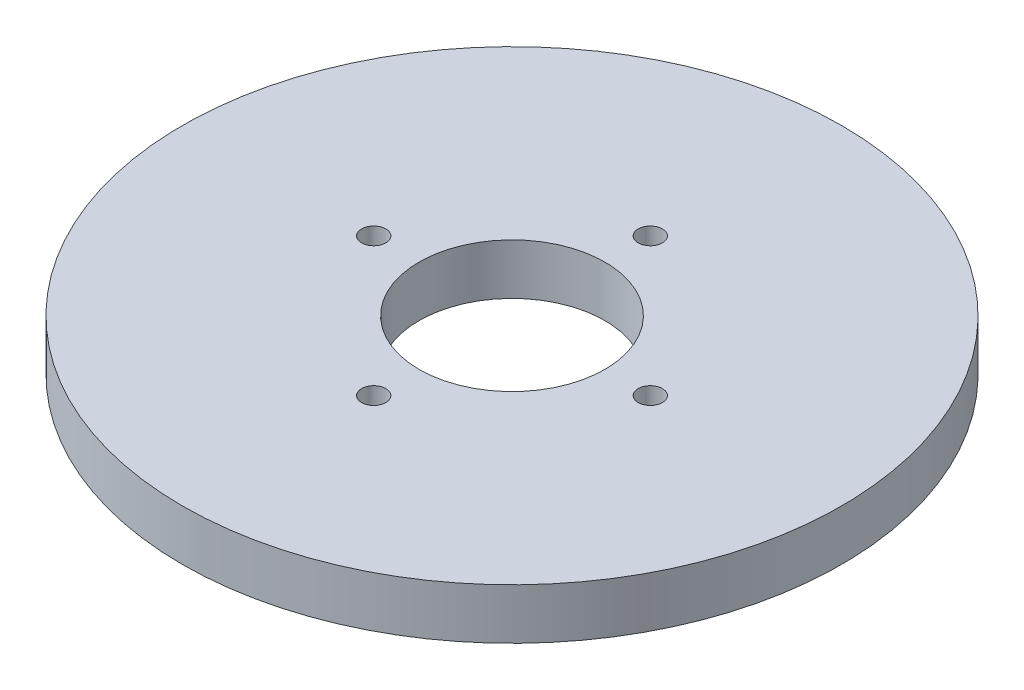
ISO-10303-21;
HEADER;
FILE_DESCRIPTION(('STEP AP214'),'2;1');
FILE_NAME('part.step','',(''),(''),'','','');
FILE_SCHEMA(('AUTOMOTIVE_DESIGN { 1 0 10303 214 1 1 1 1 }'));
ENDSEC;
DATA;
#1=APPLICATION_CONTEXT('core data for automotive mechanical design processes');
#2=APPLICATION_PROTOCOL_DEFINITION('international standard','automotive_design',2000,#1);
#3=PRODUCT_CONTEXT('',#1,'mechanical');
#4=PRODUCT('Part','Part','',(#3));
#5=PRODUCT_RELATED_PRODUCT_CATEGORY('part','',(#4));
#6=PRODUCT_DEFINITION_FORMATION('','',#4);
#7=PRODUCT_DEFINITION_CONTEXT('part definition',#1,'design');
#8=PRODUCT_DEFINITION('design','',#6,#7);
#9=PRODUCT_DEFINITION_SHAPE('','',#8);
#10=(LENGTH_UNIT() NAMED_UNIT(*) SI_UNIT(.MILLI.,.METRE.));
#11=(NAMED_UNIT(*) PLANE_ANGLE_UNIT() SI_UNIT($,.RADIAN.));
#12=(NAMED_UNIT(*) SI_UNIT($,.STERADIAN.) SOLID_ANGLE_UNIT());
#13=UNCERTAINTY_MEASURE_WITH_UNIT(LENGTH_MEASURE(1.E-05),#10,'distance_accuracy_value','');
#14=(GEOMETRIC_REPRESENTATION_CONTEXT(3) GLOBAL_UNCERTAINTY_ASSIGNED_CONTEXT((#13)) GLOBAL_UNIT_ASSIGNED_CONTEXT((#10,
#11,#12)) REPRESENTATION_CONTEXT('',''));
#15=CARTESIAN_POINT('',(0.,0.,0.));
#16=DIRECTION('',(0.,0.,1.));
#17=DIRECTION('',(1.,0.,0.));
#18=AXIS2_PLACEMENT_3D('',#15,#16,#17);
#19=CARTESIAN_POINT('',(0.,15.,0.));
#20=DIRECTION('',(0.,-1.,0.));
#21=DIRECTION('',(0.,0.,-1.));
#22=AXIS2_PLACEMENT_3D('',#19,#20,#21);
#23=CYLINDRICAL_SURFACE('',#22,97.5);
#24=CARTESIAN_POINT('',(0.,15.,0.));
#25=DIRECTION('',(0.,1.,0.));
#26=DIRECTION('',(0.,0.,1.));
#27=AXIS2_PLACEMENT_3D('',#24,#25,#26);
#28=CIRCLE('',#27,97.5);
#29=CARTESIAN_POINT('',(0.,15.,97.5));
#30=VERTEX_POINT('',#29);
#31=EDGE_CURVE('E10',#30,#30,#28,.T.);
#32=ORIENTED_EDGE('',*,*,#31,.F.);
#33=EDGE_LOOP('',(#32));
#34=FACE_BOUND('',#33,.T.);
#35=CARTESIAN_POINT('',(0.,0.,0.));
#36=DIRECTION('',(0.,1.,0.));
#37=DIRECTION('',(0.,0.,1.));
#38=AXIS2_PLACEMENT_3D('',#35,#36,#37);
#39=CIRCLE('',#38,97.5);
#40=CARTESIAN_POINT('',(0.,0.,97.5));
#41=VERTEX_POINT('',#40);
#42=EDGE_CURVE('E37',#41,#41,#39,.T.);
#43=ORIENTED_EDGE('',*,*,#42,.T.);
#44=EDGE_LOOP('',(#43));
#45=FACE_BOUND('',#44,.T.);
#46=ADVANCED_FACE('F40',(#34,#45),#23,.T.);
#47=CARTESIAN_POINT('',(0.,15.,0.));
#48=DIRECTION('',(0.,1.,0.));
#49=DIRECTION('',(0.,0.,1.));
#50=AXIS2_PLACEMENT_3D('',#47,#48,#49);
#51=PLANE('',#50);
#52=CARTESIAN_POINT('',(1.42843780219517E-13,15.,40.9120846874829));
#53=DIRECTION('',(0.,1.,0.));
#54=DIRECTION('',(1.,0.,0.));
#55=AXIS2_PLACEMENT_3D('',#52,#53,#54);
#56=CIRCLE('',#55,3.58964056744345);
#57=CARTESIAN_POINT('',(1.42843780219517E-13,15.,44.5017252549264));
#58=VERTEX_POINT('',#57);
#59=EDGE_CURVE('E71',#58,#58,#56,.T.);
#60=ORIENTED_EDGE('',*,*,#59,.F.);
#61=EDGE_LOOP('',(#60));
#62=FACE_BOUND('',#61,.T.);
#63=CARTESIAN_POINT('',(40.9120846874829,15.,0.));
#64=DIRECTION('',(0.,1.,0.));
#65=DIRECTION('',(0.,0.,-1.));
#66=AXIS2_PLACEMENT_3D('',#63,#64,#65);
#67=CIRCLE('',#66,3.58964056744345);
#68=CARTESIAN_POINT('',(40.9120846874829,15.,3.58964056744345));
#69=VERTEX_POINT('',#68);
#70=EDGE_CURVE('E70',#69,#69,#67,.T.);
#71=ORIENTED_EDGE('',*,*,#70,.F.);
#72=EDGE_LOOP('',(#71));
#73=FACE_BOUND('',#72,.T.);
#74=CARTESIAN_POINT('',(-4.2853134065855E-13,15.,-40.9120846874829));
#75=DIRECTION('',(0.,1.,0.));
#76=DIRECTION('',(-1.,0.,0.));
#77=AXIS2_PLACEMENT_3D('',#74,#75,#76);
#78=CIRCLE('',#77,3.58964056744345);
#79=CARTESIAN_POINT('',(-4.2853134065855E-13,15.,-37.3224441200395));
#80=VERTEX_POINT('',#79);
#81=EDGE_CURVE('E61',#80,#80,#78,.T.);
#82=ORIENTED_EDGE('',*,*,#81,.F.);
#83=EDGE_LOOP('',(#82));
#84=FACE_BOUND('',#83,.T.);
#85=CARTESIAN_POINT('',(-40.9120846874829,15.,0.));
#86=DIRECTION('',(0.,1.,0.));
#87=DIRECTION('',(0.,0.,1.));
#88=AXIS2_PLACEMENT_3D('',#85,#86,#87);
#89=CIRCLE('',#88,3.58964056744345);
#90=CARTESIAN_POINT('',(-40.9120846874829,15.,3.58964056744345));
#91=VERTEX_POINT('',#90);
#92=EDGE_CURVE('E54',#91,#91,#89,.T.);
#93=ORIENTED_EDGE('',*,*,#92,.F.);
#94=EDGE_LOOP('',(#93));
#95=FACE_BOUND('',#94,.T.);
#96=CARTESIAN_POINT('',(0.,15.,0.));
#97=DIRECTION('',(0.,1.,0.));
#98=DIRECTION('',(0.,0.,1.));
#99=AXIS2_PLACEMENT_3D('',#96,#97,#98);
#100=CIRCLE('',#99,27.5);
#101=CARTESIAN_POINT('',(0.,15.,27.5));
#102=VERTEX_POINT('',#101);
#103=EDGE_CURVE('E50',#102,#102,#100,.T.);
#104=ORIENTED_EDGE('',*,*,#103,.F.);
#105=EDGE_LOOP('',(#104));
#106=FACE_BOUND('',#105,.T.);
#107=ORIENTED_EDGE('',*,*,#31,.T.);
#108=EDGE_LOOP('',(#107));
#109=FACE_BOUND('',#108,.T.);
#110=ADVANCED_FACE('F86',(#62,#73,#84,#95,#106,#109),#51,.T.);
#111=CARTESIAN_POINT('',(0.,0.,0.));
#112=DIRECTION('',(0.,1.,0.));
#113=DIRECTION('',(0.,0.,1.));
#114=AXIS2_PLACEMENT_3D('',#111,#112,#113);
#115=PLANE('',#114);
#116=CARTESIAN_POINT('',(0.,0.,0.));
#117=DIRECTION('',(0.,1.,0.));
#118=DIRECTION('',(0.,0.,1.));
#119=AXIS2_PLACEMENT_3D('',#116,#117,#118);
#120=CIRCLE('',#119,27.5);
#121=CARTESIAN_POINT('',(0.,0.,27.5));
#122=VERTEX_POINT('',#121);
#123=EDGE_CURVE('E47',#122,#122,#120,.T.);
#124=ORIENTED_EDGE('',*,*,#123,.T.);
#125=EDGE_LOOP('',(#124));
#126=FACE_BOUND('',#125,.T.);
#127=ORIENTED_EDGE('',*,*,#42,.F.);
#128=EDGE_LOOP('',(#127));
#129=FACE_BOUND('',#128,.T.);
#130=ADVANCED_FACE('F93',(#126,#129),#115,.F.);
#131=CARTESIAN_POINT('',(0.,15.,0.));
#132=DIRECTION('',(0.,-1.,0.));
#133=DIRECTION('',(0.,0.,-1.));
#134=AXIS2_PLACEMENT_3D('',#131,#132,#133);
#135=CYLINDRICAL_SURFACE('',#134,27.5);
#136=ORIENTED_EDGE('',*,*,#103,.T.);
#137=EDGE_LOOP('',(#136));
#138=FACE_BOUND('',#137,.T.);
#139=ORIENTED_EDGE('',*,*,#123,.F.);
#140=EDGE_LOOP('',(#139));
#141=FACE_BOUND('',#140,.T.);
#142=ADVANCED_FACE('F101',(#138,#141),#135,.F.);
#143=CARTESIAN_POINT('',(-40.9120846874829,5.35384562569408,0.));
#144=DIRECTION('',(0.,1.,0.));
#145=DIRECTION('',(0.,0.,1.));
#146=AXIS2_PLACEMENT_3D('',#143,#144,#145);
#147=CYLINDRICAL_SURFACE('',#146,3.58964056744345);
#148=CARTESIAN_POINT('',(-40.9120846874829,5.35384562569408,0.));
#149=DIRECTION('',(0.,1.,0.));
#150=DIRECTION('',(0.,0.,1.));
#151=AXIS2_PLACEMENT_3D('',#148,#149,#150);
#152=CIRCLE('',#151,3.58964056744345);
#153=CARTESIAN_POINT('',(-40.9120846874829,5.35384562569408,3.58964056744345));
#154=VERTEX_POINT('',#153);
#155=EDGE_CURVE('E55',#154,#154,#152,.T.);
#156=CARTESIAN_POINT('',(-40.9120846874829,5.35384562569408,3.58964056744345));
#157=CARTESIAN_POINT('',(-40.9120846874829,5.45432640042643,3.58964056744345));
#158=CARTESIAN_POINT('',(-40.9120846874829,5.55480717515879,3.58964056744345));
#159=CARTESIAN_POINT('',(-40.9120846874829,5.75576872462349,3.58964056744345));
#160=CARTESIAN_POINT('',(-40.9120846874829,5.85624949935585,3.58964056744345));
#161=CARTESIAN_POINT('',(-40.9120846874829,6.05721104882055,3.58964056744345));
#162=CARTESIAN_POINT('',(-40.9120846874829,6.15769182355291,3.58964056744345));
#163=CARTESIAN_POINT('',(-40.9120846874829,6.35865337301761,3.58964056744345));
#164=CARTESIAN_POINT('',(-40.9120846874829,6.45913414774997,3.58964056744345));
#165=CARTESIAN_POINT('',(-40.9120846874829,6.66009569721467,3.58964056744345));
#166=CARTESIAN_POINT('',(-40.9120846874829,6.76057647194703,3.58964056744345));
#167=CARTESIAN_POINT('',(-40.9120846874829,6.96153802141173,3.58964056744345));
#168=CARTESIAN_POINT('',(-40.9120846874829,7.06201879614409,3.58964056744345));
#169=CARTESIAN_POINT('',(-40.9120846874829,7.26298034560879,3.58964056744345));
#170=CARTESIAN_POINT('',(-40.9120846874829,7.36346112034115,3.58964056744345));
#171=CARTESIAN_POINT('',(-40.9120846874829,7.56442266980585,3.58964056744345));
#172=CARTESIAN_POINT('',(-40.9120846874829,7.6649034445382,3.58964056744345));
#173=CARTESIAN_POINT('',(-40.9120846874829,7.86586499400291,3.58964056744345));
#174=CARTESIAN_POINT('',(-40.9120846874829,7.96634576873527,3.58964056744345));
#175=CARTESIAN_POINT('',(-40.9120846874829,8.16730731819997,3.58964056744345));
#176=CARTESIAN_POINT('',(-40.9120846874829,8.26778809293232,3.58964056744345));
#177=CARTESIAN_POINT('',(-40.9120846874829,8.46874964239703,3.58964056744345));
#178=CARTESIAN_POINT('',(-40.9120846874829,8.56923041712939,3.58964056744345));
#179=CARTESIAN_POINT('',(-40.9120846874829,8.77019196659409,3.58964056744345));
#180=CARTESIAN_POINT('',(-40.9120846874829,8.87067274132645,3.58964056744345));
#181=CARTESIAN_POINT('',(-40.9120846874829,9.07163429079115,3.58964056744345));
#182=CARTESIAN_POINT('',(-40.9120846874829,9.1721150655235,3.58964056744345));
#183=CARTESIAN_POINT('',(-40.9120846874829,9.37307661498821,3.58964056744345));
#184=CARTESIAN_POINT('',(-40.9120846874829,9.47355738972056,3.58964056744345));
#185=CARTESIAN_POINT('',(-40.9120846874829,9.67451893918527,3.58964056744345));
#186=CARTESIAN_POINT('',(-40.9120846874829,9.77499971391762,3.58964056744345));
#187=CARTESIAN_POINT('',(-40.9120846874829,9.97596126338233,3.58964056744345));
#188=CARTESIAN_POINT('',(-40.9120846874829,10.0764420381147,3.58964056744345));
#189=CARTESIAN_POINT('',(-40.9120846874829,10.2774035875794,3.58964056744345));
#190=CARTESIAN_POINT('',(-40.9120846874829,10.3778843623117,3.58964056744345));
#191=CARTESIAN_POINT('',(-40.9120846874829,10.5788459117765,3.58964056744345));
#192=CARTESIAN_POINT('',(-40.9120846874829,10.6793266865088,3.58964056744345));
#193=CARTESIAN_POINT('',(-40.9120846874829,10.8802882359735,3.58964056744345));
#194=CARTESIAN_POINT('',(-40.9120846874829,10.9807690107059,3.58964056744345));
#195=CARTESIAN_POINT('',(-40.9120846874829,11.1817305601706,3.58964056744345));
#196=CARTESIAN_POINT('',(-40.9120846874829,11.2822113349029,3.58964056744345));
#197=CARTESIAN_POINT('',(-40.9120846874829,11.4831728843676,3.58964056744345));
#198=CARTESIAN_POINT('',(-40.9120846874829,11.5836536591,3.58964056744345));
#199=CARTESIAN_POINT('',(-40.9120846874829,11.7846152085647,3.58964056744345));
#200=CARTESIAN_POINT('',(-40.9120846874829,11.885095983297,3.58964056744345));
#201=CARTESIAN_POINT('',(-40.9120846874829,12.0860575327617,3.58964056744345));
#202=CARTESIAN_POINT('',(-40.9120846874829,12.1865383074941,3.58964056744345));
#203=CARTESIAN_POINT('',(-40.9120846874829,12.3874998569588,3.58964056744345));
#204=CARTESIAN_POINT('',(-40.9120846874829,12.4879806316912,3.58964056744345));
#205=CARTESIAN_POINT('',(-40.9120846874829,12.6889421811559,3.58964056744345));
#206=CARTESIAN_POINT('',(-40.9120846874829,12.7894229558882,3.58964056744345));
#207=CARTESIAN_POINT('',(-40.9120846874829,12.9903845053529,3.58964056744345));
#208=CARTESIAN_POINT('',(-40.9120846874829,13.0908652800853,3.58964056744345));
#209=CARTESIAN_POINT('',(-40.9120846874829,13.29182682955,3.58964056744345));
#210=CARTESIAN_POINT('',(-40.9120846874829,13.3923076042823,3.58964056744345));
#211=CARTESIAN_POINT('',(-40.9120846874829,13.5932691537471,3.58964056744345));
#212=CARTESIAN_POINT('',(-40.9120846874829,13.6937499284794,3.58964056744345));
#213=CARTESIAN_POINT('',(-40.9120846874829,13.8947114779441,3.58964056744345));
#214=CARTESIAN_POINT('',(-40.9120846874829,13.9951922526765,3.58964056744345));
#215=CARTESIAN_POINT('',(-40.9120846874829,14.1961538021412,3.58964056744345));
#216=CARTESIAN_POINT('',(-40.9120846874829,14.2966345768735,3.58964056744345));
#217=CARTESIAN_POINT('',(-40.9120846874829,14.4975961263382,3.58964056744345));
#218=CARTESIAN_POINT('',(-40.9120846874829,14.5980769010706,3.58964056744345));
#219=CARTESIAN_POINT('',(-40.9120846874829,14.7990384505353,3.58964056744345));
#220=CARTESIAN_POINT('',(-40.9120846874829,14.8995192252676,3.58964056744345));
#221=CARTESIAN_POINT('',(-40.9120846874829,15.,3.58964056744345));
#222=B_SPLINE_CURVE_WITH_KNOTS('',3,(#156,#157,#158,#159,#160,#161,#162,#163,#164,#165,#166,
#167,#168,#169,#170,#171,#172,#173,#174,#175,#176,#177,#178,#179,#180,#181,#182,#183,#184,#185,
#186,#187,#188,#189,#190,#191,#192,#193,#194,#195,#196,#197,#198,#199,#200,#201,#202,#203,#204,
#205,#206,#207,#208,#209,#210,#211,#212,#213,#214,#215,#216,#217,#218,#219,#220,#221),
.UNSPECIFIED.,.F.,.F.,(4,2,2,2,2,2,2,2,2,2,2,2,2,2,2,2,2,2,2,2,2,2,2,2,2,2,2,2,2,2,2,2,4),(0.,
0.301442324197061,0.60288464839412,0.904326972591181,1.20576929678824,1.5072116209853,
1.80865394518236,2.11009626937942,2.41153859357648,2.71298091777354,3.0144232419706,
3.31586556616766,3.61730789036472,3.91875021456178,4.22019253875884,4.5216348629559,
4.82307718715296,5.12451951135002,5.42596183554708,5.72740415974414,6.0288464839412,
6.33028880813826,6.63173113233532,6.93317345653238,7.23461578072944,7.5360581049265,
7.83750042912356,8.13894275332062,8.44038507751768,8.74182740171474,9.0432697259118,
9.34471205010886,9.64615437430592),.UNSPECIFIED.);
#223=EDGE_CURVE('BSEAM102',#154,#91,#222,.T.);
#224=ORIENTED_EDGE('',*,*,#155,.F.);
#225=ORIENTED_EDGE('',*,*,#92,.T.);
#226=ORIENTED_EDGE('',*,*,#223,.T.);
#227=ORIENTED_EDGE('',*,*,#223,.F.);
#228=EDGE_LOOP('',(#224,#226,#225,#227));
#229=FACE_BOUND('',#228,.T.);
#230=ADVANCED_FACE('F102',(#229),#147,.F.);
#231=CARTESIAN_POINT('',(-40.9120846874829,5.35384562569408,0.));
#232=DIRECTION('',(0.,1.,0.));
#233=DIRECTION('',(0.,0.,1.));
#234=AXIS2_PLACEMENT_3D('',#231,#232,#233);
#235=PLANE('',#234);
#236=ORIENTED_EDGE('',*,*,#155,.T.);
#237=EDGE_LOOP('',(#236));
#238=FACE_BOUND('',#237,.T.);
#239=ADVANCED_FACE('F133',(#238),#235,.T.);
#240=CARTESIAN_POINT('',(-4.2853134065855E-13,5.35384562569408,-40.9120846874829));
#241=DIRECTION('',(0.,1.,0.));
#242=DIRECTION('',(0.,0.,1.));
#243=AXIS2_PLACEMENT_3D('',#240,#241,#242);
#244=CYLINDRICAL_SURFACE('',#243,3.58964056744345);
#245=CARTESIAN_POINT('',(-4.2853134065855E-13,5.35384562569408,-40.9120846874829));
#246=DIRECTION('',(0.,1.,0.));
#247=DIRECTION('',(-1.,0.,0.));
#248=AXIS2_PLACEMENT_3D('',#245,#246,#247);
#249=CIRCLE('',#248,3.58964056744345);
#250=CARTESIAN_POINT('',(-4.2853134065855E-13,5.35384562569408,-37.3224441200395));
#251=VERTEX_POINT('',#250);
#252=EDGE_CURVE('E63',#251,#251,#249,.T.);
#253=CARTESIAN_POINT('',(-4.2853134065855E-13,5.35384562569408,-37.3224441200395));
#254=CARTESIAN_POINT('',(-4.2853134065855E-13,5.45432640042643,-37.3224441200395));
#255=CARTESIAN_POINT('',(-4.2853134065855E-13,5.55480717515879,-37.3224441200395));
#256=CARTESIAN_POINT('',(-4.2853134065855E-13,5.75576872462349,-37.3224441200395));
#257=CARTESIAN_POINT('',(-4.2853134065855E-13,5.85624949935585,-37.3224441200395));
#258=CARTESIAN_POINT('',(-4.2853134065855E-13,6.05721104882055,-37.3224441200395));
#259=CARTESIAN_POINT('',(-4.2853134065855E-13,6.15769182355291,-37.3224441200395));
#260=CARTESIAN_POINT('',(-4.2853134065855E-13,6.35865337301761,-37.3224441200395));
#261=CARTESIAN_POINT('',(-4.2853134065855E-13,6.45913414774997,-37.3224441200395));
#262=CARTESIAN_POINT('',(-4.2853134065855E-13,6.66009569721467,-37.3224441200395));
#263=CARTESIAN_POINT('',(-4.2853134065855E-13,6.76057647194703,-37.3224441200395));
#264=CARTESIAN_POINT('',(-4.2853134065855E-13,6.96153802141173,-37.3224441200395));
#265=CARTESIAN_POINT('',(-4.2853134065855E-13,7.06201879614409,-37.3224441200395));
#266=CARTESIAN_POINT('',(-4.2853134065855E-13,7.26298034560879,-37.3224441200395));
#267=CARTESIAN_POINT('',(-4.2853134065855E-13,7.36346112034115,-37.3224441200395));
#268=CARTESIAN_POINT('',(-4.2853134065855E-13,7.56442266980585,-37.3224441200395));
#269=CARTESIAN_POINT('',(-4.2853134065855E-13,7.6649034445382,-37.3224441200395));
#270=CARTESIAN_POINT('',(-4.2853134065855E-13,7.86586499400291,-37.3224441200395));
#271=CARTESIAN_POINT('',(-4.2853134065855E-13,7.96634576873527,-37.3224441200395));
#272=CARTESIAN_POINT('',(-4.2853134065855E-13,8.16730731819997,-37.3224441200395));
#273=CARTESIAN_POINT('',(-4.2853134065855E-13,8.26778809293232,-37.3224441200395));
#274=CARTESIAN_POINT('',(-4.2853134065855E-13,8.46874964239703,-37.3224441200395));
#275=CARTESIAN_POINT('',(-4.2853134065855E-13,8.56923041712939,-37.3224441200395));
#276=CARTESIAN_POINT('',(-4.2853134065855E-13,8.77019196659409,-37.3224441200395));
#277=CARTESIAN_POINT('',(-4.2853134065855E-13,8.87067274132645,-37.3224441200395));
#278=CARTESIAN_POINT('',(-4.2853134065855E-13,9.07163429079115,-37.3224441200395));
#279=CARTESIAN_POINT('',(-4.2853134065855E-13,9.1721150655235,-37.3224441200395));
#280=CARTESIAN_POINT('',(-4.2853134065855E-13,9.37307661498821,-37.3224441200395));
#281=CARTESIAN_POINT('',(-4.2853134065855E-13,9.47355738972056,-37.3224441200395));
#282=CARTESIAN_POINT('',(-4.2853134065855E-13,9.67451893918527,-37.3224441200395));
#283=CARTESIAN_POINT('',(-4.2853134065855E-13,9.77499971391762,-37.3224441200395));
#284=CARTESIAN_POINT('',(-4.2853134065855E-13,9.97596126338233,-37.3224441200395));
#285=CARTESIAN_POINT('',(-4.2853134065855E-13,10.0764420381147,-37.3224441200395));
#286=CARTESIAN_POINT('',(-4.2853134065855E-13,10.2774035875794,-37.3224441200395));
#287=CARTESIAN_POINT('',(-4.2853134065855E-13,10.3778843623117,-37.3224441200395));
#288=CARTESIAN_POINT('',(-4.2853134065855E-13,10.5788459117765,-37.3224441200395));
#289=CARTESIAN_POINT('',(-4.2853134065855E-13,10.6793266865088,-37.3224441200395));
#290=CARTESIAN_POINT('',(-4.2853134065855E-13,10.8802882359735,-37.3224441200395));
#291=CARTESIAN_POINT('',(-4.2853134065855E-13,10.9807690107059,-37.3224441200395));
#292=CARTESIAN_POINT('',(-4.2853134065855E-13,11.1817305601706,-37.3224441200395));
#293=CARTESIAN_POINT('',(-4.2853134065855E-13,11.2822113349029,-37.3224441200395));
#294=CARTESIAN_POINT('',(-4.2853134065855E-13,11.4831728843676,-37.3224441200395));
#295=CARTESIAN_POINT('',(-4.2853134065855E-13,11.5836536591,-37.3224441200395));
#296=CARTESIAN_POINT('',(-4.2853134065855E-13,11.7846152085647,-37.3224441200395));
#297=CARTESIAN_POINT('',(-4.2853134065855E-13,11.885095983297,-37.3224441200395));
#298=CARTESIAN_POINT('',(-4.2853134065855E-13,12.0860575327617,-37.3224441200395));
#299=CARTESIAN_POINT('',(-4.2853134065855E-13,12.1865383074941,-37.3224441200395));
#300=CARTESIAN_POINT('',(-4.2853134065855E-13,12.3874998569588,-37.3224441200395));
#301=CARTESIAN_POINT('',(-4.2853134065855E-13,12.4879806316912,-37.3224441200395));
#302=CARTESIAN_POINT('',(-4.2853134065855E-13,12.6889421811559,-37.3224441200395));
#303=CARTESIAN_POINT('',(-4.2853134065855E-13,12.7894229558882,-37.3224441200395));
#304=CARTESIAN_POINT('',(-4.2853134065855E-13,12.9903845053529,-37.3224441200395));
#305=CARTESIAN_POINT('',(-4.2853134065855E-13,13.0908652800853,-37.3224441200395));
#306=CARTESIAN_POINT('',(-4.2853134065855E-13,13.29182682955,-37.3224441200395));
#307=CARTESIAN_POINT('',(-4.2853134065855E-13,13.3923076042823,-37.3224441200395));
#308=CARTESIAN_POINT('',(-4.2853134065855E-13,13.5932691537471,-37.3224441200395));
#309=CARTESIAN_POINT('',(-4.2853134065855E-13,13.6937499284794,-37.3224441200395));
#310=CARTESIAN_POINT('',(-4.2853134065855E-13,13.8947114779441,-37.3224441200395));
#311=CARTESIAN_POINT('',(-4.2853134065855E-13,13.9951922526765,-37.3224441200395));
#312=CARTESIAN_POINT('',(-4.2853134065855E-13,14.1961538021412,-37.3224441200395));
#313=CARTESIAN_POINT('',(-4.2853134065855E-13,14.2966345768735,-37.3224441200395));
#314=CARTESIAN_POINT('',(-4.2853134065855E-13,14.4975961263382,-37.3224441200395));
#315=CARTESIAN_POINT('',(-4.2853134065855E-13,14.5980769010706,-37.3224441200395));
#316=CARTESIAN_POINT('',(-4.2853134065855E-13,14.7990384505353,-37.3224441200395));
#317=CARTESIAN_POINT('',(-4.2853134065855E-13,14.8995192252676,-37.3224441200395));
#318=CARTESIAN_POINT('',(-4.2853134065855E-13,15.,-37.3224441200395));
#319=B_SPLINE_CURVE_WITH_KNOTS('',3,(#253,#254,#255,#256,#257,#258,#259,#260,#261,#262,#263,
#264,#265,#266,#267,#268,#269,#270,#271,#272,#273,#274,#275,#276,#277,#278,#279,#280,#281,#282,
#283,#284,#285,#286,#287,#288,#289,#290,#291,#292,#293,#294,#295,#296,#297,#298,#299,#300,#301,
#302,#303,#304,#305,#306,#307,#308,#309,#310,#311,#312,#313,#314,#315,#316,#317,#318),
.UNSPECIFIED.,.F.,.F.,(4,2,2,2,2,2,2,2,2,2,2,2,2,2,2,2,2,2,2,2,2,2,2,2,2,2,2,2,2,2,2,2,4),(0.,
0.301442324197061,0.60288464839412,0.904326972591181,1.20576929678824,1.5072116209853,
1.80865394518236,2.11009626937942,2.41153859357648,2.71298091777354,3.0144232419706,
3.31586556616766,3.61730789036472,3.91875021456178,4.22019253875884,4.5216348629559,
4.82307718715296,5.12451951135002,5.42596183554708,5.72740415974414,6.0288464839412,
6.33028880813826,6.63173113233532,6.93317345653238,7.23461578072944,7.5360581049265,
7.83750042912356,8.13894275332062,8.44038507751768,8.74182740171474,9.0432697259118,
9.34471205010886,9.64615437430592),.UNSPECIFIED.);
#320=EDGE_CURVE('BSEAM142',#251,#80,#319,.T.);
#321=ORIENTED_EDGE('',*,*,#252,.F.);
#322=ORIENTED_EDGE('',*,*,#81,.T.);
#323=ORIENTED_EDGE('',*,*,#320,.T.);
#324=ORIENTED_EDGE('',*,*,#320,.F.);
#325=EDGE_LOOP('',(#321,#323,#322,#324));
#326=FACE_BOUND('',#325,.T.);
#327=ADVANCED_FACE('F142',(#326),#244,.F.);
#328=CARTESIAN_POINT('',(-4.2853134065855E-13,5.35384562569408,-40.9120846874829));
#329=DIRECTION('',(0.,1.,0.));
#330=DIRECTION('',(-1.,0.,0.));
#331=AXIS2_PLACEMENT_3D('',#328,#329,#330);
#332=PLANE('',#331);
#333=ORIENTED_EDGE('',*,*,#252,.T.);
#334=EDGE_LOOP('',(#333));
#335=FACE_BOUND('',#334,.T.);
#336=ADVANCED_FACE('F156',(#335),#332,.T.);
#337=CARTESIAN_POINT('',(40.9120846874829,5.35384562569408,0.));
#338=DIRECTION('',(0.,1.,0.));
#339=DIRECTION('',(0.,0.,1.));
#340=AXIS2_PLACEMENT_3D('',#337,#338,#339);
#341=CYLINDRICAL_SURFACE('',#340,3.58964056744345);
#342=CARTESIAN_POINT('',(40.9120846874829,5.35384562569408,0.));
#343=DIRECTION('',(0.,1.,0.));
#344=DIRECTION('',(0.,0.,-1.));
#345=AXIS2_PLACEMENT_3D('',#342,#343,#344);
#346=CIRCLE('',#345,3.58964056744345);
#347=CARTESIAN_POINT('',(40.9120846874829,5.35384562569408,3.58964056744345));
#348=VERTEX_POINT('',#347);
#349=EDGE_CURVE('E69',#348,#348,#346,.T.);
#350=CARTESIAN_POINT('',(40.9120846874829,5.35384562569408,3.58964056744345));
#351=CARTESIAN_POINT('',(40.9120846874829,5.45432640042643,3.58964056744345));
#352=CARTESIAN_POINT('',(40.9120846874829,5.55480717515879,3.58964056744345));
#353=CARTESIAN_POINT('',(40.9120846874829,5.75576872462349,3.58964056744345));
#354=CARTESIAN_POINT('',(40.9120846874829,5.85624949935585,3.58964056744345));
#355=CARTESIAN_POINT('',(40.9120846874829,6.05721104882055,3.58964056744345));
#356=CARTESIAN_POINT('',(40.9120846874829,6.15769182355291,3.58964056744345));
#357=CARTESIAN_POINT('',(40.9120846874829,6.35865337301761,3.58964056744345));
#358=CARTESIAN_POINT('',(40.9120846874829,6.45913414774997,3.58964056744345));
#359=CARTESIAN_POINT('',(40.9120846874829,6.66009569721467,3.58964056744345));
#360=CARTESIAN_POINT('',(40.9120846874829,6.76057647194703,3.58964056744345));
#361=CARTESIAN_POINT('',(40.9120846874829,6.96153802141173,3.58964056744345));
#362=CARTESIAN_POINT('',(40.9120846874829,7.06201879614409,3.58964056744345));
#363=CARTESIAN_POINT('',(40.9120846874829,7.26298034560879,3.58964056744345));
#364=CARTESIAN_POINT('',(40.9120846874829,7.36346112034115,3.58964056744345));
#365=CARTESIAN_POINT('',(40.9120846874829,7.56442266980585,3.58964056744345));
#366=CARTESIAN_POINT('',(40.9120846874829,7.6649034445382,3.58964056744345));
#367=CARTESIAN_POINT('',(40.9120846874829,7.86586499400291,3.58964056744345));
#368=CARTESIAN_POINT('',(40.9120846874829,7.96634576873527,3.58964056744345));
#369=CARTESIAN_POINT('',(40.9120846874829,8.16730731819997,3.58964056744345));
#370=CARTESIAN_POINT('',(40.9120846874829,8.26778809293232,3.58964056744345));
#371=CARTESIAN_POINT('',(40.9120846874829,8.46874964239703,3.58964056744345));
#372=CARTESIAN_POINT('',(40.9120846874829,8.56923041712939,3.58964056744345));
#373=CARTESIAN_POINT('',(40.9120846874829,8.77019196659409,3.58964056744345));
#374=CARTESIAN_POINT('',(40.9120846874829,8.87067274132645,3.58964056744345));
#375=CARTESIAN_POINT('',(40.9120846874829,9.07163429079115,3.58964056744345));
#376=CARTESIAN_POINT('',(40.9120846874829,9.1721150655235,3.58964056744345));
#377=CARTESIAN_POINT('',(40.9120846874829,9.37307661498821,3.58964056744345));
#378=CARTESIAN_POINT('',(40.9120846874829,9.47355738972056,3.58964056744345));
#379=CARTESIAN_POINT('',(40.9120846874829,9.67451893918527,3.58964056744345));
#380=CARTESIAN_POINT('',(40.9120846874829,9.77499971391762,3.58964056744345));
#381=CARTESIAN_POINT('',(40.9120846874829,9.97596126338233,3.58964056744345));
#382=CARTESIAN_POINT('',(40.9120846874829,10.0764420381147,3.58964056744345));
#383=CARTESIAN_POINT('',(40.9120846874829,10.2774035875794,3.58964056744345));
#384=CARTESIAN_POINT('',(40.9120846874829,10.3778843623117,3.58964056744345));
#385=CARTESIAN_POINT('',(40.9120846874829,10.5788459117765,3.58964056744345));
#386=CARTESIAN_POINT('',(40.9120846874829,10.6793266865088,3.58964056744345));
#387=CARTESIAN_POINT('',(40.9120846874829,10.8802882359735,3.58964056744345));
#388=CARTESIAN_POINT('',(40.9120846874829,10.9807690107059,3.58964056744345));
#389=CARTESIAN_POINT('',(40.9120846874829,11.1817305601706,3.58964056744345));
#390=CARTESIAN_POINT('',(40.9120846874829,11.2822113349029,3.58964056744345));
#391=CARTESIAN_POINT('',(40.9120846874829,11.4831728843676,3.58964056744345));
#392=CARTESIAN_POINT('',(40.9120846874829,11.5836536591,3.58964056744345));
#393=CARTESIAN_POINT('',(40.9120846874829,11.7846152085647,3.58964056744345));
#394=CARTESIAN_POINT('',(40.9120846874829,11.885095983297,3.58964056744345));
#395=CARTESIAN_POINT('',(40.9120846874829,12.0860575327617,3.58964056744345));
#396=CARTESIAN_POINT('',(40.9120846874829,12.1865383074941,3.58964056744345));
#397=CARTESIAN_POINT('',(40.9120846874829,12.3874998569588,3.58964056744345));
#398=CARTESIAN_POINT('',(40.9120846874829,12.4879806316912,3.58964056744345));
#399=CARTESIAN_POINT('',(40.9120846874829,12.6889421811559,3.58964056744345));
#400=CARTESIAN_POINT('',(40.9120846874829,12.7894229558882,3.58964056744345));
#401=CARTESIAN_POINT('',(40.9120846874829,12.9903845053529,3.58964056744345));
#402=CARTESIAN_POINT('',(40.9120846874829,13.0908652800853,3.58964056744345));
#403=CARTESIAN_POINT('',(40.9120846874829,13.29182682955,3.58964056744345));
#404=CARTESIAN_POINT('',(40.9120846874829,13.3923076042823,3.58964056744345));
#405=CARTESIAN_POINT('',(40.9120846874829,13.5932691537471,3.58964056744345));
#406=CARTESIAN_POINT('',(40.9120846874829,13.6937499284794,3.58964056744345));
#407=CARTESIAN_POINT('',(40.9120846874829,13.8947114779441,3.58964056744345));
#408=CARTESIAN_POINT('',(40.9120846874829,13.9951922526765,3.58964056744345));
#409=CARTESIAN_POINT('',(40.9120846874829,14.1961538021412,3.58964056744345));
#410=CARTESIAN_POINT('',(40.9120846874829,14.2966345768735,3.58964056744345));
#411=CARTESIAN_POINT('',(40.9120846874829,14.4975961263382,3.58964056744345));
#412=CARTESIAN_POINT('',(40.9120846874829,14.5980769010706,3.58964056744345));
#413=CARTESIAN_POINT('',(40.9120846874829,14.7990384505353,3.58964056744345));
#414=CARTESIAN_POINT('',(40.9120846874829,14.8995192252676,3.58964056744345));
#415=CARTESIAN_POINT('',(40.9120846874829,15.,3.58964056744345));
#416=B_SPLINE_CURVE_WITH_KNOTS('',3,(#350,#351,#352,#353,#354,#355,#356,#357,#358,#359,#360,
#361,#362,#363,#364,#365,#366,#367,#368,#369,#370,#371,#372,#373,#374,#375,#376,#377,#378,#379,
#380,#381,#382,#383,#384,#385,#386,#387,#388,#389,#390,#391,#392,#393,#394,#395,#396,#397,#398,
#399,#400,#401,#402,#403,#404,#405,#406,#407,#408,#409,#410,#411,#412,#413,#414,#415),
.UNSPECIFIED.,.F.,.F.,(4,2,2,2,2,2,2,2,2,2,2,2,2,2,2,2,2,2,2,2,2,2,2,2,2,2,2,2,2,2,2,2,4),(0.,
0.301442324197061,0.60288464839412,0.904326972591181,1.20576929678824,1.5072116209853,
1.80865394518236,2.11009626937942,2.41153859357648,2.71298091777354,3.0144232419706,
3.31586556616766,3.61730789036472,3.91875021456178,4.22019253875884,4.5216348629559,
4.82307718715296,5.12451951135002,5.42596183554708,5.72740415974414,6.0288464839412,
6.33028880813826,6.63173113233532,6.93317345653238,7.23461578072944,7.5360581049265,
7.83750042912356,8.13894275332062,8.44038507751768,8.74182740171474,9.0432697259118,
9.34471205010886,9.64615437430592),.UNSPECIFIED.);
#417=EDGE_CURVE('BSEAM164',#348,#69,#416,.T.);
#418=ORIENTED_EDGE('',*,*,#349,.F.);
#419=ORIENTED_EDGE('',*,*,#70,.T.);
#420=ORIENTED_EDGE('',*,*,#417,.T.);
#421=ORIENTED_EDGE('',*,*,#417,.F.);
#422=EDGE_LOOP('',(#418,#420,#419,#421));
#423=FACE_BOUND('',#422,.T.);
#424=ADVANCED_FACE('F164',(#423),#341,.F.);
#425=CARTESIAN_POINT('',(40.9120846874829,5.35384562569408,0.));
#426=DIRECTION('',(0.,1.,0.));
#427=DIRECTION('',(0.,0.,-1.));
#428=AXIS2_PLACEMENT_3D('',#425,#426,#427);
#429=PLANE('',#428);
#430=ORIENTED_EDGE('',*,*,#349,.T.);
#431=EDGE_LOOP('',(#430));
#432=FACE_BOUND('',#431,.T.);
#433=ADVANCED_FACE('F83',(#432),#429,.T.);
#434=CARTESIAN_POINT('',(1.42843780219517E-13,5.35384562569408,40.9120846874829));
#435=DIRECTION('',(0.,1.,0.));
#436=DIRECTION('',(0.,0.,1.));
#437=AXIS2_PLACEMENT_3D('',#434,#435,#436);
#438=CYLINDRICAL_SURFACE('',#437,3.58964056744345);
#439=CARTESIAN_POINT('',(1.42843780219517E-13,5.35384562569408,40.9120846874829));
#440=DIRECTION('',(0.,1.,0.));
#441=DIRECTION('',(1.,0.,0.));
#442=AXIS2_PLACEMENT_3D('',#439,#440,#441);
#443=CIRCLE('',#442,3.58964056744345);
#444=CARTESIAN_POINT('',(1.42843780219517E-13,5.35384562569408,44.5017252549264));
#445=VERTEX_POINT('',#444);
#446=EDGE_CURVE('E59',#445,#445,#443,.T.);
#447=CARTESIAN_POINT('',(1.42843780219517E-13,5.35384562569408,44.5017252549264));
#448=CARTESIAN_POINT('',(1.42843780219517E-13,5.45432640042643,44.5017252549264));
#449=CARTESIAN_POINT('',(1.42843780219517E-13,5.55480717515879,44.5017252549264));
#450=CARTESIAN_POINT('',(1.42843780219517E-13,5.75576872462349,44.5017252549264));
#451=CARTESIAN_POINT('',(1.42843780219517E-13,5.85624949935585,44.5017252549264));
#452=CARTESIAN_POINT('',(1.42843780219517E-13,6.05721104882055,44.5017252549264));
#453=CARTESIAN_POINT('',(1.42843780219517E-13,6.15769182355291,44.5017252549264));
#454=CARTESIAN_POINT('',(1.42843780219517E-13,6.35865337301761,44.5017252549264));
#455=CARTESIAN_POINT('',(1.42843780219517E-13,6.45913414774997,44.5017252549264));
#456=CARTESIAN_POINT('',(1.42843780219517E-13,6.66009569721467,44.5017252549264));
#457=CARTESIAN_POINT('',(1.42843780219517E-13,6.76057647194703,44.5017252549264));
#458=CARTESIAN_POINT('',(1.42843780219517E-13,6.96153802141173,44.5017252549264));
#459=CARTESIAN_POINT('',(1.42843780219517E-13,7.06201879614409,44.5017252549264));
#460=CARTESIAN_POINT('',(1.42843780219517E-13,7.26298034560879,44.5017252549264));
#461=CARTESIAN_POINT('',(1.42843780219517E-13,7.36346112034115,44.5017252549264));
#462=CARTESIAN_POINT('',(1.42843780219517E-13,7.56442266980585,44.5017252549264));
#463=CARTESIAN_POINT('',(1.42843780219517E-13,7.6649034445382,44.5017252549264));
#464=CARTESIAN_POINT('',(1.42843780219517E-13,7.86586499400291,44.5017252549264));
#465=CARTESIAN_POINT('',(1.42843780219517E-13,7.96634576873527,44.5017252549264));
#466=CARTESIAN_POINT('',(1.42843780219517E-13,8.16730731819997,44.5017252549264));
#467=CARTESIAN_POINT('',(1.42843780219517E-13,8.26778809293232,44.5017252549264));
#468=CARTESIAN_POINT('',(1.42843780219517E-13,8.46874964239703,44.5017252549264));
#469=CARTESIAN_POINT('',(1.42843780219517E-13,8.56923041712939,44.5017252549264));
#470=CARTESIAN_POINT('',(1.42843780219517E-13,8.77019196659409,44.5017252549264));
#471=CARTESIAN_POINT('',(1.42843780219517E-13,8.87067274132645,44.5017252549264));
#472=CARTESIAN_POINT('',(1.42843780219517E-13,9.07163429079115,44.5017252549264));
#473=CARTESIAN_POINT('',(1.42843780219517E-13,9.1721150655235,44.5017252549264));
#474=CARTESIAN_POINT('',(1.42843780219517E-13,9.37307661498821,44.5017252549264));
#475=CARTESIAN_POINT('',(1.42843780219517E-13,9.47355738972056,44.5017252549264));
#476=CARTESIAN_POINT('',(1.42843780219517E-13,9.67451893918527,44.5017252549264));
#477=CARTESIAN_POINT('',(1.42843780219517E-13,9.77499971391762,44.5017252549264));
#478=CARTESIAN_POINT('',(1.42843780219517E-13,9.97596126338233,44.5017252549264));
#479=CARTESIAN_POINT('',(1.42843780219517E-13,10.0764420381147,44.5017252549264));
#480=CARTESIAN_POINT('',(1.42843780219517E-13,10.2774035875794,44.5017252549264));
#481=CARTESIAN_POINT('',(1.42843780219517E-13,10.3778843623117,44.5017252549264));
#482=CARTESIAN_POINT('',(1.42843780219517E-13,10.5788459117765,44.5017252549264));
#483=CARTESIAN_POINT('',(1.42843780219517E-13,10.6793266865088,44.5017252549264));
#484=CARTESIAN_POINT('',(1.42843780219517E-13,10.8802882359735,44.5017252549264));
#485=CARTESIAN_POINT('',(1.42843780219517E-13,10.9807690107059,44.5017252549264));
#486=CARTESIAN_POINT('',(1.42843780219517E-13,11.1817305601706,44.5017252549264));
#487=CARTESIAN_POINT('',(1.42843780219517E-13,11.2822113349029,44.5017252549264));
#488=CARTESIAN_POINT('',(1.42843780219517E-13,11.4831728843676,44.5017252549264));
#489=CARTESIAN_POINT('',(1.42843780219517E-13,11.5836536591,44.5017252549264));
#490=CARTESIAN_POINT('',(1.42843780219517E-13,11.7846152085647,44.5017252549264));
#491=CARTESIAN_POINT('',(1.42843780219517E-13,11.885095983297,44.5017252549264));
#492=CARTESIAN_POINT('',(1.42843780219517E-13,12.0860575327617,44.5017252549264));
#493=CARTESIAN_POINT('',(1.42843780219517E-13,12.1865383074941,44.5017252549264));
#494=CARTESIAN_POINT('',(1.42843780219517E-13,12.3874998569588,44.5017252549264));
#495=CARTESIAN_POINT('',(1.42843780219517E-13,12.4879806316912,44.5017252549264));
#496=CARTESIAN_POINT('',(1.42843780219517E-13,12.6889421811559,44.5017252549264));
#497=CARTESIAN_POINT('',(1.42843780219517E-13,12.7894229558882,44.5017252549264));
#498=CARTESIAN_POINT('',(1.42843780219517E-13,12.9903845053529,44.5017252549264));
#499=CARTESIAN_POINT('',(1.42843780219517E-13,13.0908652800853,44.5017252549264));
#500=CARTESIAN_POINT('',(1.42843780219517E-13,13.29182682955,44.5017252549264));
#501=CARTESIAN_POINT('',(1.42843780219517E-13,13.3923076042823,44.5017252549264));
#502=CARTESIAN_POINT('',(1.42843780219517E-13,13.5932691537471,44.5017252549264));
#503=CARTESIAN_POINT('',(1.42843780219517E-13,13.6937499284794,44.5017252549264));
#504=CARTESIAN_POINT('',(1.42843780219517E-13,13.8947114779441,44.5017252549264));
#505=CARTESIAN_POINT('',(1.42843780219517E-13,13.9951922526765,44.5017252549264));
#506=CARTESIAN_POINT('',(1.42843780219517E-13,14.1961538021412,44.5017252549264));
#507=CARTESIAN_POINT('',(1.42843780219517E-13,14.2966345768735,44.5017252549264));
#508=CARTESIAN_POINT('',(1.42843780219517E-13,14.4975961263382,44.5017252549264));
#509=CARTESIAN_POINT('',(1.42843780219517E-13,14.5980769010706,44.5017252549264));
#510=CARTESIAN_POINT('',(1.42843780219517E-13,14.7990384505353,44.5017252549264));
#511=CARTESIAN_POINT('',(1.42843780219517E-13,14.8995192252676,44.5017252549264));
#512=CARTESIAN_POINT('',(1.42843780219517E-13,15.,44.5017252549264));
#513=B_SPLINE_CURVE_WITH_KNOTS('',3,(#447,#448,#449,#450,#451,#452,#453,#454,#455,#456,#457,
#458,#459,#460,#461,#462,#463,#464,#465,#466,#467,#468,#469,#470,#471,#472,#473,#474,#475,#476,
#477,#478,#479,#480,#481,#482,#483,#484,#485,#486,#487,#488,#489,#490,#491,#492,#493,#494,#495,
#496,#497,#498,#499,#500,#501,#502,#503,#504,#505,#506,#507,#508,#509,#510,#511,#512),
.UNSPECIFIED.,.F.,.F.,(4,2,2,2,2,2,2,2,2,2,2,2,2,2,2,2,2,2,2,2,2,2,2,2,2,2,2,2,2,2,2,2,4),(0.,
0.301442324197061,0.60288464839412,0.904326972591181,1.20576929678824,1.5072116209853,
1.80865394518236,2.11009626937942,2.41153859357648,2.71298091777354,3.0144232419706,
3.31586556616766,3.61730789036472,3.91875021456178,4.22019253875884,4.5216348629559,
4.82307718715296,5.12451951135002,5.42596183554708,5.72740415974414,6.0288464839412,
6.33028880813826,6.63173113233532,6.93317345653238,7.23461578072944,7.5360581049265,
7.83750042912356,8.13894275332062,8.44038507751768,8.74182740171474,9.0432697259118,
9.34471205010886,9.64615437430592),.UNSPECIFIED.);
#514=EDGE_CURVE('BSEAM81',#445,#58,#513,.T.);
#515=ORIENTED_EDGE('',*,*,#446,.F.);
#516=ORIENTED_EDGE('',*,*,#59,.T.);
#517=ORIENTED_EDGE('',*,*,#514,.T.);
#518=ORIENTED_EDGE('',*,*,#514,.F.);
#519=EDGE_LOOP('',(#515,#517,#516,#518));
#520=FACE_BOUND('',#519,.T.);
#521=ADVANCED_FACE('F81',(#520),#438,.F.);
#522=CARTESIAN_POINT('',(1.42843780219517E-13,5.35384562569408,40.9120846874829));
#523=DIRECTION('',(0.,1.,0.));
#524=DIRECTION('',(1.,0.,0.));
#525=AXIS2_PLACEMENT_3D('',#522,#523,#524);
#526=PLANE('',#525);
#527=ORIENTED_EDGE('',*,*,#446,.T.);
#528=EDGE_LOOP('',(#527));
#529=FACE_BOUND('',#528,.T.);
#530=ADVANCED_FACE('F78',(#529),#526,.T.);
#531=CLOSED_SHELL('',(#46,#110,#130,#142,#230,#239,#327,#336,#424,#433,#521,#530));
#532=MANIFOLD_SOLID_BREP('B2',#531);
#533=ADVANCED_BREP_SHAPE_REPRESENTATION('',(#18,#532),#14);
#534=SHAPE_DEFINITION_REPRESENTATION(#9,#533);
ENDSEC;
END-ISO-10303-21;
